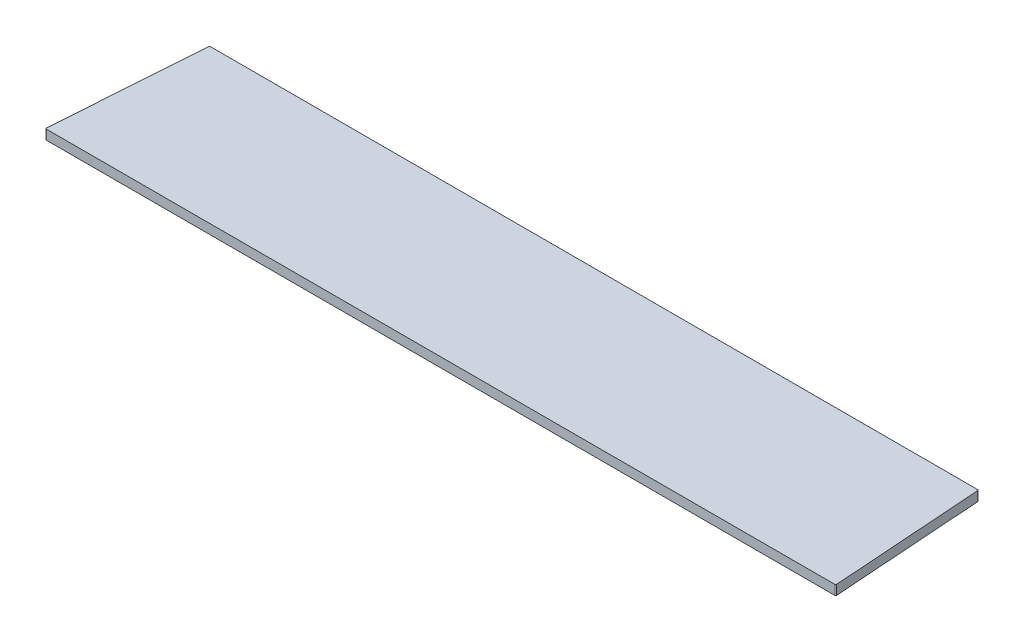
ISO-10303-21;
HEADER;
FILE_DESCRIPTION(('STEP AP214'),'2;1');
FILE_NAME('part.step','',(''),(''),'','','');
FILE_SCHEMA(('AUTOMOTIVE_DESIGN { 1 0 10303 214 1 1 1 1 }'));
ENDSEC;
DATA;
#1=APPLICATION_CONTEXT('core data for automotive mechanical design processes');
#2=APPLICATION_PROTOCOL_DEFINITION('international standard','automotive_design',2000,#1);
#3=PRODUCT_CONTEXT('',#1,'mechanical');
#4=PRODUCT('Part','Part','',(#3));
#5=PRODUCT_RELATED_PRODUCT_CATEGORY('part','',(#4));
#6=PRODUCT_DEFINITION_FORMATION('','',#4);
#7=PRODUCT_DEFINITION_CONTEXT('part definition',#1,'design');
#8=PRODUCT_DEFINITION('design','',#6,#7);
#9=PRODUCT_DEFINITION_SHAPE('','',#8);
#10=(LENGTH_UNIT() NAMED_UNIT(*) SI_UNIT(.MILLI.,.METRE.));
#11=(NAMED_UNIT(*) PLANE_ANGLE_UNIT() SI_UNIT($,.RADIAN.));
#12=(NAMED_UNIT(*) SI_UNIT($,.STERADIAN.) SOLID_ANGLE_UNIT());
#13=UNCERTAINTY_MEASURE_WITH_UNIT(LENGTH_MEASURE(1.E-05),#10,'distance_accuracy_value','');
#14=(GEOMETRIC_REPRESENTATION_CONTEXT(3) GLOBAL_UNCERTAINTY_ASSIGNED_CONTEXT((#13)) GLOBAL_UNIT_ASSIGNED_CONTEXT((#10,
#11,#12)) REPRESENTATION_CONTEXT('',''));
#15=CARTESIAN_POINT('',(0.,0.,0.));
#16=DIRECTION('',(0.,0.,1.));
#17=DIRECTION('',(1.,0.,0.));
#18=AXIS2_PLACEMENT_3D('',#15,#16,#17);
#19=CARTESIAN_POINT('',(-400.811710089038,-10.,-160.));
#20=DIRECTION('',(-0.997564050259824,0.,-0.0697564737441287));
#21=DIRECTION('',(-0.0697564737441287,0.,0.997564050259824));
#22=AXIS2_PLACEMENT_3D('',#19,#20,#21);
#23=PLANE('',#22);
#24=DIRECTION('',(-0.0697564737441287,0.,0.997564050259824));
#25=VECTOR('',#24,1.);
#26=CARTESIAN_POINT('',(-400.811710089038,0.,-160.));
#27=LINE('',#26,#25);
#28=CARTESIAN_POINT('',(-400.87675905316,0.,-159.069756473744));
#29=VERTEX_POINT('',#28);
#30=CARTESIAN_POINT('',(-411.925195340235,0.,-1.0697564737441));
#31=VERTEX_POINT('',#30);
#32=EDGE_CURVE('E107',#29,#31,#27,.T.);
#33=ORIENTED_EDGE('',*,*,#32,.F.);
#34=DIRECTION('',(0.,1.,0.));
#35=VECTOR('',#34,1.);
#36=CARTESIAN_POINT('',(-400.87675905316,-10.,-159.069756473744));
#37=LINE('',#36,#35);
#38=CARTESIAN_POINT('',(-400.87675905316,-10.,-159.069756473744));
#39=VERTEX_POINT('',#38);
#40=EDGE_CURVE('E11',#29,#39,#37,.F.);
#41=ORIENTED_EDGE('',*,*,#40,.T.);
#42=DIRECTION('',(-0.0697564737441287,0.,0.997564050259824));
#43=VECTOR('',#42,1.);
#44=CARTESIAN_POINT('',(-400.811710089038,-10.,-160.));
#45=LINE('',#44,#43);
#46=CARTESIAN_POINT('',(-411.925195340235,-10.,-1.0697564737441));
#47=VERTEX_POINT('',#46);
#48=EDGE_CURVE('E157',#39,#47,#45,.T.);
#49=ORIENTED_EDGE('',*,*,#48,.T.);
#50=DIRECTION('',(0.,1.,0.));
#51=VECTOR('',#50,1.);
#52=CARTESIAN_POINT('',(-411.925195340235,-10.,-1.06975647374413));
#53=LINE('',#52,#51);
#54=EDGE_CURVE('E44',#47,#31,#53,.T.);
#55=ORIENTED_EDGE('',*,*,#54,.T.);
#56=EDGE_LOOP('',(#33,#41,#49,#55));
#57=FACE_BOUND('',#56,.T.);
#58=ADVANCED_FACE('F36',(#57),#23,.T.);
#59=CARTESIAN_POINT('',(-400.811710089038,-10.,-160.));
#60=DIRECTION('',(0.,0.,-1.));
#61=DIRECTION('',(-1.,0.,0.));
#62=AXIS2_PLACEMENT_3D('',#59,#60,#61);
#63=PLANE('',#62);
#64=DIRECTION('',(-1.,0.,0.));
#65=VECTOR('',#64,1.);
#66=CARTESIAN_POINT('',(-400.811710089038,0.,-160.));
#67=LINE('',#66,#65);
#68=CARTESIAN_POINT('',(399.8791950029,0.,-160.));
#69=VERTEX_POINT('',#68);
#70=CARTESIAN_POINT('',(-399.8791950029,0.,-160.));
#71=VERTEX_POINT('',#70);
#72=EDGE_CURVE('E132',#69,#71,#67,.T.);
#73=ORIENTED_EDGE('',*,*,#72,.F.);
#74=DIRECTION('',(0.,1.,0.));
#75=VECTOR('',#74,1.);
#76=CARTESIAN_POINT('',(399.8791950029,-10.,-160.));
#77=LINE('',#76,#75);
#78=CARTESIAN_POINT('',(399.8791950029,-10.,-160.));
#79=VERTEX_POINT('',#78);
#80=EDGE_CURVE('E58',#69,#79,#77,.F.);
#81=ORIENTED_EDGE('',*,*,#80,.T.);
#82=DIRECTION('',(-1.,0.,0.));
#83=VECTOR('',#82,1.);
#84=CARTESIAN_POINT('',(-400.811710089038,-10.,-160.));
#85=LINE('',#84,#83);
#86=CARTESIAN_POINT('',(-399.8791950029,-10.,-160.));
#87=VERTEX_POINT('',#86);
#88=EDGE_CURVE('E126',#79,#87,#85,.T.);
#89=ORIENTED_EDGE('',*,*,#88,.T.);
#90=DIRECTION('',(0.,1.,0.));
#91=VECTOR('',#90,1.);
#92=CARTESIAN_POINT('',(-399.8791950029,-10.,-160.));
#93=LINE('',#92,#91);
#94=EDGE_CURVE('E151',#87,#71,#93,.T.);
#95=ORIENTED_EDGE('',*,*,#94,.T.);
#96=EDGE_LOOP('',(#73,#81,#89,#95));
#97=FACE_BOUND('',#96,.T.);
#98=ADVANCED_FACE('F189',(#97),#63,.T.);
#99=CARTESIAN_POINT('',(400.811710089038,-10.,-160.));
#100=DIRECTION('',(0.997564050259824,0.,-0.0697564737441297));
#101=DIRECTION('',(-0.0697564737441297,0.,-0.997564050259824));
#102=AXIS2_PLACEMENT_3D('',#99,#100,#101);
#103=PLANE('',#102);
#104=DIRECTION('',(-0.0697564737441297,0.,-0.997564050259824));
#105=VECTOR('',#104,1.);
#106=CARTESIAN_POINT('',(400.811710089038,0.,-160.));
#107=LINE('',#106,#105);
#108=CARTESIAN_POINT('',(411.925195340235,0.,-1.06975647374416));
#109=VERTEX_POINT('',#108);
#110=CARTESIAN_POINT('',(400.87675905316,0.,-159.069756473744));
#111=VERTEX_POINT('',#110);
#112=EDGE_CURVE('E122',#109,#111,#107,.T.);
#113=ORIENTED_EDGE('',*,*,#112,.F.);
#114=DIRECTION('',(0.,1.,0.));
#115=VECTOR('',#114,1.);
#116=CARTESIAN_POINT('',(411.925195340235,-10.,-1.0697564737441));
#117=LINE('',#116,#115);
#118=CARTESIAN_POINT('',(411.925195340235,-10.,-1.06975647374416));
#119=VERTEX_POINT('',#118);
#120=EDGE_CURVE('E143',#109,#119,#117,.F.);
#121=ORIENTED_EDGE('',*,*,#120,.T.);
#122=DIRECTION('',(-0.0697564737441297,0.,-0.997564050259824));
#123=VECTOR('',#122,1.);
#124=CARTESIAN_POINT('',(400.811710089038,-10.,-160.));
#125=LINE('',#124,#123);
#126=CARTESIAN_POINT('',(400.87675905316,-10.,-159.069756473744));
#127=VERTEX_POINT('',#126);
#128=EDGE_CURVE('E129',#119,#127,#125,.T.);
#129=ORIENTED_EDGE('',*,*,#128,.T.);
#130=DIRECTION('',(0.,1.,0.));
#131=VECTOR('',#130,1.);
#132=CARTESIAN_POINT('',(400.87675905316,-10.,-159.069756473744));
#133=LINE('',#132,#131);
#134=EDGE_CURVE('E140',#127,#111,#133,.T.);
#135=ORIENTED_EDGE('',*,*,#134,.T.);
#136=EDGE_LOOP('',(#113,#121,#129,#135));
#137=FACE_BOUND('',#136,.T.);
#138=ADVANCED_FACE('F169',(#137),#103,.T.);
#139=CARTESIAN_POINT('',(-412.,-10.,0.));
#140=DIRECTION('',(0.,0.,1.));
#141=DIRECTION('',(1.,0.,0.));
#142=AXIS2_PLACEMENT_3D('',#139,#140,#141);
#143=PLANE('',#142);
#144=DIRECTION('',(1.,0.,0.));
#145=VECTOR('',#144,1.);
#146=CARTESIAN_POINT('',(-412.,-10.,0.));
#147=LINE('',#146,#145);
#148=CARTESIAN_POINT('',(-410.927631289975,-10.,0.));
#149=VERTEX_POINT('',#148);
#150=CARTESIAN_POINT('',(410.927631289975,-10.,0.));
#151=VERTEX_POINT('',#150);
#152=EDGE_CURVE('E158',#149,#151,#147,.T.);
#153=ORIENTED_EDGE('',*,*,#152,.T.);
#154=DIRECTION('',(0.,1.,0.));
#155=VECTOR('',#154,1.);
#156=CARTESIAN_POINT('',(410.927631289975,-10.,0.));
#157=LINE('',#156,#155);
#158=CARTESIAN_POINT('',(410.927631289975,0.,0.));
#159=VERTEX_POINT('',#158);
#160=EDGE_CURVE('E113',#151,#159,#157,.T.);
#161=ORIENTED_EDGE('',*,*,#160,.T.);
#162=DIRECTION('',(1.,0.,0.));
#163=VECTOR('',#162,1.);
#164=CARTESIAN_POINT('',(-412.,0.,0.));
#165=LINE('',#164,#163);
#166=CARTESIAN_POINT('',(-410.927631289975,0.,0.));
#167=VERTEX_POINT('',#166);
#168=EDGE_CURVE('E105',#167,#159,#165,.T.);
#169=ORIENTED_EDGE('',*,*,#168,.F.);
#170=DIRECTION('',(0.,1.,0.));
#171=VECTOR('',#170,1.);
#172=CARTESIAN_POINT('',(-410.927631289975,-10.,0.));
#173=LINE('',#172,#171);
#174=EDGE_CURVE('E119',#167,#149,#173,.F.);
#175=ORIENTED_EDGE('',*,*,#174,.T.);
#176=EDGE_LOOP('',(#153,#161,#169,#175));
#177=FACE_BOUND('',#176,.T.);
#178=ADVANCED_FACE('F118',(#177),#143,.T.);
#179=CARTESIAN_POINT('',(0.,-10.,0.));
#180=DIRECTION('',(0.,1.,0.));
#181=DIRECTION('',(0.,0.,1.));
#182=AXIS2_PLACEMENT_3D('',#179,#180,#181);
#183=PLANE('',#182);
#184=ORIENTED_EDGE('',*,*,#128,.F.);
#185=CARTESIAN_POINT('',(410.927631289975,-10.,-1.));
#186=DIRECTION('',(0.,1.,0.));
#187=DIRECTION('',(0.,0.,1.));
#188=AXIS2_PLACEMENT_3D('',#185,#186,#187);
#189=CIRCLE('',#188,1.);
#190=EDGE_CURVE('E149',#119,#151,#189,.F.);
#191=ORIENTED_EDGE('',*,*,#190,.T.);
#192=ORIENTED_EDGE('',*,*,#152,.F.);
#193=CARTESIAN_POINT('',(-410.927631289975,-10.,-1.));
#194=DIRECTION('',(0.,1.,0.));
#195=DIRECTION('',(0.,0.,1.));
#196=AXIS2_PLACEMENT_3D('',#193,#194,#195);
#197=CIRCLE('',#196,1.);
#198=EDGE_CURVE('E125',#149,#47,#197,.F.);
#199=ORIENTED_EDGE('',*,*,#198,.T.);
#200=ORIENTED_EDGE('',*,*,#48,.F.);
#201=CARTESIAN_POINT('',(-399.8791950029,-10.,-159.));
#202=DIRECTION('',(0.,1.,0.));
#203=DIRECTION('',(0.,0.,1.));
#204=AXIS2_PLACEMENT_3D('',#201,#202,#203);
#205=CIRCLE('',#204,1.);
#206=EDGE_CURVE('E51',#39,#87,#205,.F.);
#207=ORIENTED_EDGE('',*,*,#206,.T.);
#208=ORIENTED_EDGE('',*,*,#88,.F.);
#209=CARTESIAN_POINT('',(399.8791950029,-10.,-159.));
#210=DIRECTION('',(0.,1.,0.));
#211=DIRECTION('',(0.,0.,1.));
#212=AXIS2_PLACEMENT_3D('',#209,#210,#211);
#213=CIRCLE('',#212,1.);
#214=EDGE_CURVE('E147',#79,#127,#213,.F.);
#215=ORIENTED_EDGE('',*,*,#214,.T.);
#216=EDGE_LOOP('',(#184,#191,#192,#199,#200,#207,#208,#215));
#217=FACE_BOUND('',#216,.T.);
#218=ADVANCED_FACE('F175',(#217),#183,.F.);
#219=CARTESIAN_POINT('',(0.,0.,0.));
#220=DIRECTION('',(0.,1.,0.));
#221=DIRECTION('',(0.,0.,1.));
#222=AXIS2_PLACEMENT_3D('',#219,#220,#221);
#223=PLANE('',#222);
#224=ORIENTED_EDGE('',*,*,#168,.T.);
#225=CARTESIAN_POINT('',(410.927631289975,0.,-1.));
#226=DIRECTION('',(0.,1.,0.));
#227=DIRECTION('',(0.,0.,1.));
#228=AXIS2_PLACEMENT_3D('',#225,#226,#227);
#229=CIRCLE('',#228,1.);
#230=EDGE_CURVE('E138',#159,#109,#229,.T.);
#231=ORIENTED_EDGE('',*,*,#230,.T.);
#232=ORIENTED_EDGE('',*,*,#112,.T.);
#233=CARTESIAN_POINT('',(399.8791950029,0.,-159.));
#234=DIRECTION('',(0.,1.,0.));
#235=DIRECTION('',(0.,0.,1.));
#236=AXIS2_PLACEMENT_3D('',#233,#234,#235);
#237=CIRCLE('',#236,1.);
#238=EDGE_CURVE('E136',#111,#69,#237,.T.);
#239=ORIENTED_EDGE('',*,*,#238,.T.);
#240=ORIENTED_EDGE('',*,*,#72,.T.);
#241=CARTESIAN_POINT('',(-399.8791950029,0.,-159.));
#242=DIRECTION('',(0.,1.,0.));
#243=DIRECTION('',(0.,0.,1.));
#244=AXIS2_PLACEMENT_3D('',#241,#242,#243);
#245=CIRCLE('',#244,1.);
#246=EDGE_CURVE('E112',#71,#29,#245,.T.);
#247=ORIENTED_EDGE('',*,*,#246,.T.);
#248=ORIENTED_EDGE('',*,*,#32,.T.);
#249=CARTESIAN_POINT('',(-410.927631289975,0.,-1.));
#250=DIRECTION('',(0.,1.,0.));
#251=DIRECTION('',(0.,0.,1.));
#252=AXIS2_PLACEMENT_3D('',#249,#250,#251);
#253=CIRCLE('',#252,1.);
#254=EDGE_CURVE('E102',#31,#167,#253,.T.);
#255=ORIENTED_EDGE('',*,*,#254,.T.);
#256=EDGE_LOOP('',(#224,#231,#232,#239,#240,#247,#248,#255));
#257=FACE_BOUND('',#256,.T.);
#258=ADVANCED_FACE('F104',(#257),#223,.T.);
#259=CARTESIAN_POINT('',(410.927631289975,-10.,-1.));
#260=DIRECTION('',(0.,1.,0.));
#261=DIRECTION('',(0.,0.,1.));
#262=AXIS2_PLACEMENT_3D('',#259,#260,#261);
#263=CYLINDRICAL_SURFACE('',#262,1.);
#264=ORIENTED_EDGE('',*,*,#190,.F.);
#265=ORIENTED_EDGE('',*,*,#120,.F.);
#266=ORIENTED_EDGE('',*,*,#230,.F.);
#267=ORIENTED_EDGE('',*,*,#160,.F.);
#268=EDGE_LOOP('',(#264,#265,#266,#267));
#269=FACE_BOUND('',#268,.T.);
#270=ADVANCED_FACE('F174',(#269),#263,.T.);
#271=CARTESIAN_POINT('',(399.8791950029,-10.,-159.));
#272=DIRECTION('',(0.,1.,0.));
#273=DIRECTION('',(0.,0.,1.));
#274=AXIS2_PLACEMENT_3D('',#271,#272,#273);
#275=CYLINDRICAL_SURFACE('',#274,1.);
#276=ORIENTED_EDGE('',*,*,#214,.F.);
#277=ORIENTED_EDGE('',*,*,#80,.F.);
#278=ORIENTED_EDGE('',*,*,#238,.F.);
#279=ORIENTED_EDGE('',*,*,#134,.F.);
#280=EDGE_LOOP('',(#276,#277,#278,#279));
#281=FACE_BOUND('',#280,.T.);
#282=ADVANCED_FACE('F178',(#281),#275,.T.);
#283=CARTESIAN_POINT('',(-399.8791950029,-10.,-159.));
#284=DIRECTION('',(0.,1.,0.));
#285=DIRECTION('',(0.,0.,1.));
#286=AXIS2_PLACEMENT_3D('',#283,#284,#285);
#287=CYLINDRICAL_SURFACE('',#286,1.);
#288=ORIENTED_EDGE('',*,*,#206,.F.);
#289=ORIENTED_EDGE('',*,*,#40,.F.);
#290=ORIENTED_EDGE('',*,*,#246,.F.);
#291=ORIENTED_EDGE('',*,*,#94,.F.);
#292=EDGE_LOOP('',(#288,#289,#290,#291));
#293=FACE_BOUND('',#292,.T.);
#294=ADVANCED_FACE('F180',(#293),#287,.T.);
#295=CARTESIAN_POINT('',(-410.927631289975,-10.,-1.));
#296=DIRECTION('',(0.,1.,0.));
#297=DIRECTION('',(0.,0.,1.));
#298=AXIS2_PLACEMENT_3D('',#295,#296,#297);
#299=CYLINDRICAL_SURFACE('',#298,1.);
#300=ORIENTED_EDGE('',*,*,#198,.F.);
#301=ORIENTED_EDGE('',*,*,#174,.F.);
#302=ORIENTED_EDGE('',*,*,#254,.F.);
#303=ORIENTED_EDGE('',*,*,#54,.F.);
#304=EDGE_LOOP('',(#300,#301,#302,#303));
#305=FACE_BOUND('',#304,.T.);
#306=ADVANCED_FACE('F38',(#305),#299,.T.);
#307=CLOSED_SHELL('',(#58,#98,#138,#178,#218,#258,#270,#282,#294,#306));
#308=MANIFOLD_SOLID_BREP('B2',#307);
#309=ADVANCED_BREP_SHAPE_REPRESENTATION('',(#18,#308),#14);
#310=SHAPE_DEFINITION_REPRESENTATION(#9,#309);
ENDSEC;
END-ISO-10303-21;
